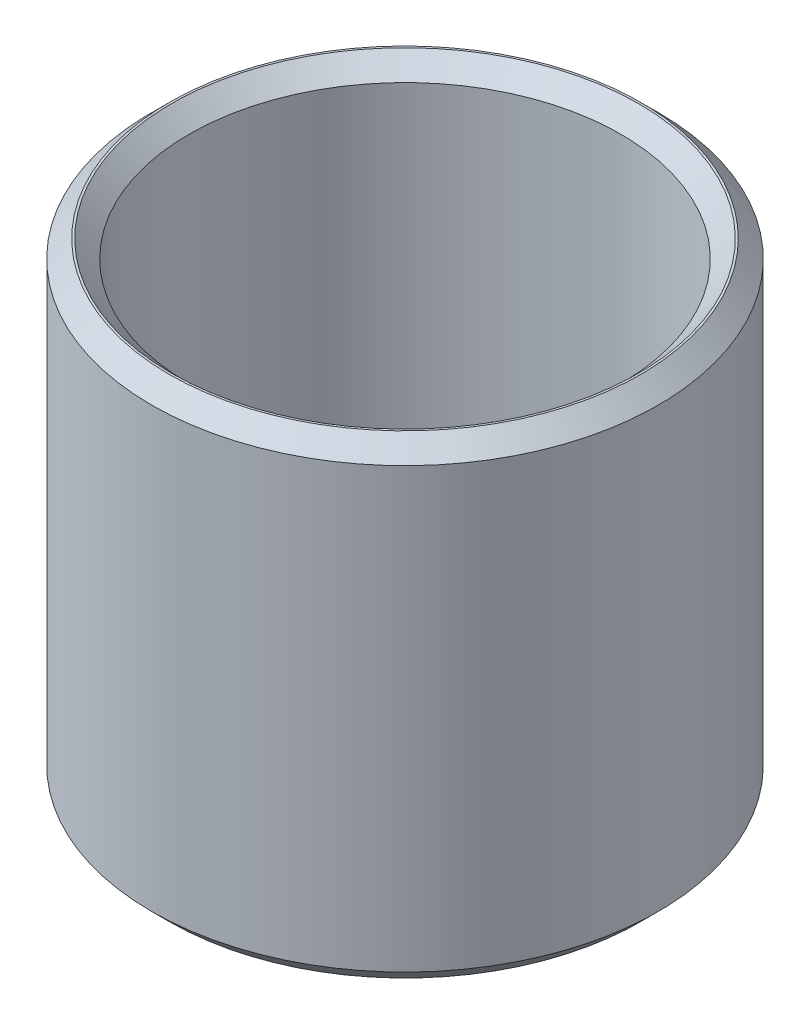
ISO-10303-21;
HEADER;
FILE_DESCRIPTION(('STEP AP214'),'2;1');
FILE_NAME('part.step','',(''),(''),'','','');
FILE_SCHEMA(('AUTOMOTIVE_DESIGN { 1 0 10303 214 1 1 1 1 }'));
ENDSEC;
DATA;
#1=APPLICATION_CONTEXT('core data for automotive mechanical design processes');
#2=APPLICATION_PROTOCOL_DEFINITION('international standard','automotive_design',2000,#1);
#3=PRODUCT_CONTEXT('',#1,'mechanical');
#4=PRODUCT('Part','Part','',(#3));
#5=PRODUCT_RELATED_PRODUCT_CATEGORY('part','',(#4));
#6=PRODUCT_DEFINITION_FORMATION('','',#4);
#7=PRODUCT_DEFINITION_CONTEXT('part definition',#1,'design');
#8=PRODUCT_DEFINITION('design','',#6,#7);
#9=PRODUCT_DEFINITION_SHAPE('','',#8);
#10=(LENGTH_UNIT() NAMED_UNIT(*) SI_UNIT(.MILLI.,.METRE.));
#11=(NAMED_UNIT(*) PLANE_ANGLE_UNIT() SI_UNIT($,.RADIAN.));
#12=(NAMED_UNIT(*) SI_UNIT($,.STERADIAN.) SOLID_ANGLE_UNIT());
#13=UNCERTAINTY_MEASURE_WITH_UNIT(LENGTH_MEASURE(1.E-05),#10,'distance_accuracy_value','');
#14=(GEOMETRIC_REPRESENTATION_CONTEXT(3) GLOBAL_UNCERTAINTY_ASSIGNED_CONTEXT((#13)) GLOBAL_UNIT_ASSIGNED_CONTEXT((#10,
#11,#12)) REPRESENTATION_CONTEXT('',''));
#15=CARTESIAN_POINT('',(0.,0.,0.));
#16=DIRECTION('',(0.,0.,1.));
#17=DIRECTION('',(1.,0.,0.));
#18=AXIS2_PLACEMENT_3D('',#15,#16,#17);
#19=CARTESIAN_POINT('',(0.,60.7918019451716,0.));
#20=DIRECTION('',(0.,-1.,0.));
#21=DIRECTION('',(0.,0.,-1.));
#22=AXIS2_PLACEMENT_3D('',#19,#20,#21);
#23=CYLINDRICAL_SURFACE('',#22,32.5);
#24=CARTESIAN_POINT('',(0.,2.26708183531674,0.));
#25=DIRECTION('',(0.,1.,0.));
#26=DIRECTION('',(0.,0.,1.));
#27=AXIS2_PLACEMENT_3D('',#24,#25,#26);
#28=CIRCLE('',#27,32.5);
#29=CARTESIAN_POINT('',(0.,2.26708183531674,32.5));
#30=VERTEX_POINT('',#29);
#31=EDGE_CURVE('E10',#30,#30,#28,.T.);
#32=ORIENTED_EDGE('',*,*,#31,.T.);
#33=EDGE_LOOP('',(#32));
#34=FACE_BOUND('',#33,.T.);
#35=CARTESIAN_POINT('',(0.,58.5247201098548,0.));
#36=DIRECTION('',(0.,1.,0.));
#37=DIRECTION('',(0.,0.,1.));
#38=AXIS2_PLACEMENT_3D('',#35,#36,#37);
#39=CIRCLE('',#38,32.5);
#40=CARTESIAN_POINT('',(0.,58.5247201098548,32.5));
#41=VERTEX_POINT('',#40);
#42=EDGE_CURVE('E50',#41,#41,#39,.F.);
#43=ORIENTED_EDGE('',*,*,#42,.T.);
#44=EDGE_LOOP('',(#43));
#45=FACE_BOUND('',#44,.T.);
#46=ADVANCED_FACE('F39',(#34,#45),#23,.T.);
#47=CARTESIAN_POINT('',(0.,60.7918019451716,0.));
#48=DIRECTION('',(0.,1.,0.));
#49=DIRECTION('',(0.,0.,1.));
#50=AXIS2_PLACEMENT_3D('',#47,#48,#49);
#51=PLANE('',#50);
#52=CARTESIAN_POINT('',(0.,60.7918019451716,0.));
#53=DIRECTION('',(0.,1.,0.));
#54=DIRECTION('',(0.,0.,1.));
#55=AXIS2_PLACEMENT_3D('',#52,#53,#54);
#56=CIRCLE('',#55,29.9612999257052);
#57=CARTESIAN_POINT('',(0.,60.7918019451716,29.9612999257052));
#58=VERTEX_POINT('',#57);
#59=EDGE_CURVE('E58',#58,#58,#56,.F.);
#60=ORIENTED_EDGE('',*,*,#59,.T.);
#61=EDGE_LOOP('',(#60));
#62=FACE_BOUND('',#61,.T.);
#63=CARTESIAN_POINT('',(0.,60.7918019451716,0.));
#64=DIRECTION('',(0.,1.,0.));
#65=DIRECTION('',(0.,0.,1.));
#66=AXIS2_PLACEMENT_3D('',#63,#64,#65);
#67=CIRCLE('',#66,30.2329181646833);
#68=CARTESIAN_POINT('',(0.,60.7918019451716,30.2329181646833));
#69=VERTEX_POINT('',#68);
#70=EDGE_CURVE('E61',#69,#69,#67,.T.);
#71=ORIENTED_EDGE('',*,*,#70,.T.);
#72=EDGE_LOOP('',(#71));
#73=FACE_BOUND('',#72,.T.);
#74=ADVANCED_FACE('F88',(#62,#73),#51,.T.);
#75=CARTESIAN_POINT('',(0.,0.,0.));
#76=DIRECTION('',(0.,1.,0.));
#77=DIRECTION('',(0.,0.,1.));
#78=AXIS2_PLACEMENT_3D('',#75,#76,#77);
#79=PLANE('',#78);
#80=CARTESIAN_POINT('',(0.,0.,0.));
#81=DIRECTION('',(0.,1.,0.));
#82=DIRECTION('',(0.,0.,1.));
#83=AXIS2_PLACEMENT_3D('',#80,#81,#82);
#84=CIRCLE('',#83,29.9612999257051);
#85=CARTESIAN_POINT('',(0.,0.,29.9612999257051));
#86=VERTEX_POINT('',#85);
#87=EDGE_CURVE('E51',#86,#86,#84,.T.);
#88=ORIENTED_EDGE('',*,*,#87,.T.);
#89=EDGE_LOOP('',(#88));
#90=FACE_BOUND('',#89,.T.);
#91=CARTESIAN_POINT('',(0.,0.,0.));
#92=DIRECTION('',(0.,1.,0.));
#93=DIRECTION('',(0.,0.,1.));
#94=AXIS2_PLACEMENT_3D('',#91,#92,#93);
#95=CIRCLE('',#94,30.2329181646832);
#96=CARTESIAN_POINT('',(0.,0.,30.2329181646832));
#97=VERTEX_POINT('',#96);
#98=EDGE_CURVE('E54',#97,#97,#95,.F.);
#99=ORIENTED_EDGE('',*,*,#98,.T.);
#100=EDGE_LOOP('',(#99));
#101=FACE_BOUND('',#100,.T.);
#102=ADVANCED_FACE('F83',(#90,#101),#79,.F.);
#103=CARTESIAN_POINT('',(0.,60.7918019451716,0.));
#104=DIRECTION('',(0.,-1.,0.));
#105=DIRECTION('',(0.,0.,-1.));
#106=AXIS2_PLACEMENT_3D('',#103,#104,#105);
#107=CYLINDRICAL_SURFACE('',#106,27.6942180903884);
#108=CARTESIAN_POINT('',(0.,58.5247201098548,0.));
#109=DIRECTION('',(0.,1.,0.));
#110=DIRECTION('',(0.,0.,1.));
#111=AXIS2_PLACEMENT_3D('',#108,#109,#110);
#112=CIRCLE('',#111,27.6942180903884);
#113=CARTESIAN_POINT('',(0.,58.5247201098548,27.6942180903884));
#114=VERTEX_POINT('',#113);
#115=EDGE_CURVE('E67',#114,#114,#112,.T.);
#116=ORIENTED_EDGE('',*,*,#115,.T.);
#117=EDGE_LOOP('',(#116));
#118=FACE_BOUND('',#117,.T.);
#119=CARTESIAN_POINT('',(0.,2.26708183531674,0.));
#120=DIRECTION('',(0.,1.,0.));
#121=DIRECTION('',(0.,0.,1.));
#122=AXIS2_PLACEMENT_3D('',#119,#120,#121);
#123=CIRCLE('',#122,27.6942180903884);
#124=CARTESIAN_POINT('',(0.,2.26708183531674,27.6942180903884));
#125=VERTEX_POINT('',#124);
#126=EDGE_CURVE('E69',#125,#125,#123,.F.);
#127=ORIENTED_EDGE('',*,*,#126,.T.);
#128=EDGE_LOOP('',(#127));
#129=FACE_BOUND('',#128,.T.);
#130=ADVANCED_FACE('F71',(#118,#129),#107,.F.);
#131=CARTESIAN_POINT('',(0.,58.5247201098548,0.));
#132=DIRECTION('',(0.,1.,0.));
#133=DIRECTION('',(0.,0.,1.));
#134=AXIS2_PLACEMENT_3D('',#131,#132,#133);
#135=CONICAL_SURFACE('',#134,27.6942180903884,0.785398163397451);
#136=ORIENTED_EDGE('',*,*,#59,.F.);
#137=EDGE_LOOP('',(#136));
#138=FACE_BOUND('',#137,.T.);
#139=ORIENTED_EDGE('',*,*,#115,.F.);
#140=EDGE_LOOP('',(#139));
#141=FACE_BOUND('',#140,.T.);
#142=ADVANCED_FACE('F77',(#138,#141),#135,.F.);
#143=CARTESIAN_POINT('',(0.,0.,0.));
#144=DIRECTION('',(0.,-1.,0.));
#145=DIRECTION('',(0.,0.,-1.));
#146=AXIS2_PLACEMENT_3D('',#143,#144,#145);
#147=CONICAL_SURFACE('',#146,29.9612999257051,0.785398163397442);
#148=ORIENTED_EDGE('',*,*,#126,.F.);
#149=EDGE_LOOP('',(#148));
#150=FACE_BOUND('',#149,.T.);
#151=ORIENTED_EDGE('',*,*,#87,.F.);
#152=EDGE_LOOP('',(#151));
#153=FACE_BOUND('',#152,.T.);
#154=ADVANCED_FACE('F73',(#150,#153),#147,.F.);
#155=CARTESIAN_POINT('',(0.,2.26708183531674,0.));
#156=DIRECTION('',(0.,1.,0.));
#157=DIRECTION('',(0.,0.,1.));
#158=AXIS2_PLACEMENT_3D('',#155,#156,#157);
#159=CONICAL_SURFACE('',#158,32.5,0.785398163397453);
#160=ORIENTED_EDGE('',*,*,#98,.F.);
#161=EDGE_LOOP('',(#160));
#162=FACE_BOUND('',#161,.T.);
#163=ORIENTED_EDGE('',*,*,#31,.F.);
#164=EDGE_LOOP('',(#163));
#165=FACE_BOUND('',#164,.T.);
#166=ADVANCED_FACE('F76',(#162,#165),#159,.T.);
#167=CARTESIAN_POINT('',(0.,60.7918019451716,0.));
#168=DIRECTION('',(0.,-1.,0.));
#169=DIRECTION('',(0.,0.,-1.));
#170=AXIS2_PLACEMENT_3D('',#167,#168,#169);
#171=CONICAL_SURFACE('',#170,30.2329181646833,0.785398163397445);
#172=ORIENTED_EDGE('',*,*,#42,.F.);
#173=EDGE_LOOP('',(#172));
#174=FACE_BOUND('',#173,.T.);
#175=ORIENTED_EDGE('',*,*,#70,.F.);
#176=EDGE_LOOP('',(#175));
#177=FACE_BOUND('',#176,.T.);
#178=ADVANCED_FACE('F45',(#174,#177),#171,.T.);
#179=CLOSED_SHELL('',(#46,#74,#102,#130,#142,#154,#166,#178));
#180=MANIFOLD_SOLID_BREP('B2',#179);
#181=ADVANCED_BREP_SHAPE_REPRESENTATION('',(#18,#180),#14);
#182=SHAPE_DEFINITION_REPRESENTATION(#9,#181);
ENDSEC;
END-ISO-10303-21;
